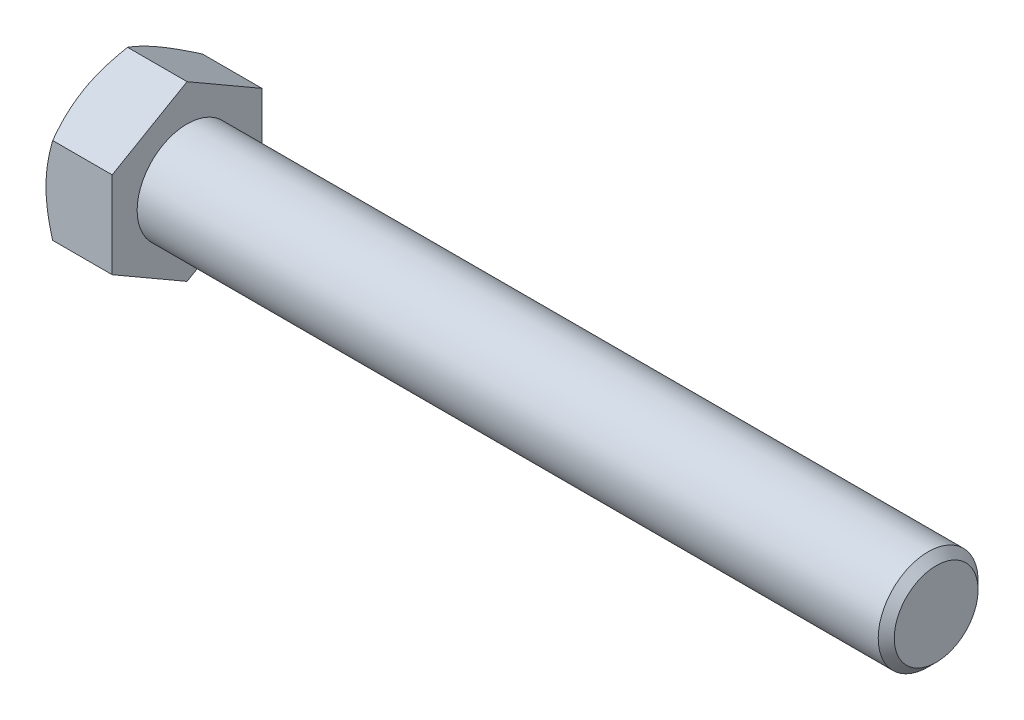
ISO-10303-21;
HEADER;
FILE_DESCRIPTION(('STEP AP214'),'2;1');
FILE_NAME('part.step','',(''),(''),'','','');
FILE_SCHEMA(('AUTOMOTIVE_DESIGN { 1 0 10303 214 1 1 1 1 }'));
ENDSEC;
DATA;
#1=APPLICATION_CONTEXT('core data for automotive mechanical design processes');
#2=APPLICATION_PROTOCOL_DEFINITION('international standard','automotive_design',2000,#1);
#3=PRODUCT_CONTEXT('',#1,'mechanical');
#4=PRODUCT('Part','Part','',(#3));
#5=PRODUCT_RELATED_PRODUCT_CATEGORY('part','',(#4));
#6=PRODUCT_DEFINITION_FORMATION('','',#4);
#7=PRODUCT_DEFINITION_CONTEXT('part definition',#1,'design');
#8=PRODUCT_DEFINITION('design','',#6,#7);
#9=PRODUCT_DEFINITION_SHAPE('','',#8);
#10=(LENGTH_UNIT() NAMED_UNIT(*) SI_UNIT(.MILLI.,.METRE.));
#11=(NAMED_UNIT(*) PLANE_ANGLE_UNIT() SI_UNIT($,.RADIAN.));
#12=(NAMED_UNIT(*) SI_UNIT($,.STERADIAN.) SOLID_ANGLE_UNIT());
#13=UNCERTAINTY_MEASURE_WITH_UNIT(LENGTH_MEASURE(1.E-05),#10,'distance_accuracy_value','');
#14=(GEOMETRIC_REPRESENTATION_CONTEXT(3) GLOBAL_UNCERTAINTY_ASSIGNED_CONTEXT((#13)) GLOBAL_UNIT_ASSIGNED_CONTEXT((#10,
#11,#12)) REPRESENTATION_CONTEXT('',''));
#15=CARTESIAN_POINT('',(0.,0.,0.));
#16=DIRECTION('',(0.,0.,1.));
#17=DIRECTION('',(1.,0.,0.));
#18=AXIS2_PLACEMENT_3D('',#15,#16,#17);
#19=CARTESIAN_POINT('',(7.95,5.19615242270663,-9.));
#20=DIRECTION('',(0.,-0.866025403784438,0.500000000000001));
#21=DIRECTION('',(0.,-0.500000000000001,-0.866025403784438));
#22=AXIS2_PLACEMENT_3D('',#19,#20,#21);
#23=PLANE('',#22);
#24=CARTESIAN_POINT('',(0.803914245071132,10.3924203154671,0.0002));
#25=CARTESIAN_POINT('',(0.737982001874055,10.2782163639798,-0.197607046401217));
#26=CARTESIAN_POINT('',(0.675041409210312,10.1635669787649,-0.396185606649946));
#27=CARTESIAN_POINT('',(0.555968997655536,9.93333715083391,-0.79495536604421));
#28=CARTESIAN_POINT('',(0.499840117752062,9.81775632901308,-0.99514722181845));
#29=CARTESIAN_POINT('',(0.395151960728961,9.58544915100228,-1.3975150570961));
#30=CARTESIAN_POINT('',(0.346610772912785,9.46872074181186,-1.5996945925006));
#31=CARTESIAN_POINT('',(0.25814851678792,9.23447001335913,-2.00542875589074));
#32=CARTESIAN_POINT('',(0.218225687483273,9.11694786135374,-2.20898309417891));
#33=CARTESIAN_POINT('',(0.148684674147114,8.88408932604662,-2.61230590830691));
#34=CARTESIAN_POINT('',(0.118837502847799,8.76877014301847,-2.812044592399));
#35=CARTESIAN_POINT('',(0.0687933098590806,8.53761579013205,-3.21241567598899));
#36=CARTESIAN_POINT('',(0.0485954355375389,8.42178066677662,-3.4130479949416));
#37=CARTESIAN_POINT('',(0.0183543473973466,8.18990950036671,-3.81466063597382));
#38=CARTESIAN_POINT('',(0.00829960958430291,8.07387383570153,-4.01564030266394));
#39=CARTESIAN_POINT('',(-0.00143766485491856,7.84169571742973,-4.41778459991642));
#40=CARTESIAN_POINT('',(-0.00112052193524544,7.72555326723328,-4.61894922457222));
#41=CARTESIAN_POINT('',(0.00916395215317108,7.50842142195782,-4.9950326125305));
#42=CARTESIAN_POINT('',(0.0178767400303951,7.40741671639993,-5.16997789436029));
#43=CARTESIAN_POINT('',(0.0429773400653684,7.20564389241818,-5.51945867708335));
#44=CARTESIAN_POINT('',(0.0593656695806683,7.10487579040239,-5.69399414955697));
#45=CARTESIAN_POINT('',(0.119656556235829,6.8029615939808,-6.21692487728551));
#46=CARTESIAN_POINT('',(0.174677482341127,6.60234990505054,-6.56439451510491));
#47=CARTESIAN_POINT('',(0.312230476325148,6.1989985076226,-7.263019628754));
#48=CARTESIAN_POINT('',(0.395345618627104,5.99631027619252,-7.61408594368717));
#49=CARTESIAN_POINT('',(0.583982539436458,5.59395639760763,-8.31098330401861));
#50=CARTESIAN_POINT('',(0.689460012893354,5.39428559809852,-8.65682327355628));
#51=CARTESIAN_POINT('',(0.803914245071127,5.19603695265279,-9.0002));
#52=B_SPLINE_CURVE_WITH_KNOTS('',3,(#24,#25,#26,#27,#28,#29,#30,#31,#32,#33,#34,#35,#36,#37,#38,
#39,#40,#41,#42,#43,#44,#45,#46,#47,#48,#49,#50,#51),.UNSPECIFIED.,.F.,.F.,(4,2,2,2,2,2,2,2,2,2,
2,2,2,4),(0.,0.713219249102578,1.42674513853509,2.14194697262263,2.85700253034481,
3.55449749123034,4.25193080859215,4.94857085059645,5.64518936892663,6.25162976378284,
6.85811104066341,8.07193747617894,9.31268391793542,10.5509947443908),.UNSPECIFIED.);
#53=CARTESIAN_POINT('',(0.803847577293366,10.3923048454133,0.));
#54=VERTEX_POINT('',#53);
#55=CARTESIAN_POINT('',(0.,7.79422863405994,-4.50000000000001));
#56=VERTEX_POINT('',#55);
#57=EDGE_CURVE('E51',#54,#56,#52,.T.);
#58=ORIENTED_EDGE('',*,*,#57,.F.);
#59=DIRECTION('',(-1.,0.,0.));
#60=VECTOR('',#59,1.);
#61=CARTESIAN_POINT('',(7.95,10.3923048454133,0.));
#62=LINE('',#61,#60);
#63=CARTESIAN_POINT('',(7.95,10.3923048454133,0.));
#64=VERTEX_POINT('',#63);
#65=EDGE_CURVE('E147',#64,#54,#62,.T.);
#66=ORIENTED_EDGE('',*,*,#65,.F.);
#67=DIRECTION('',(0.,0.500000000000001,0.866025403784438));
#68=VECTOR('',#67,1.);
#69=CARTESIAN_POINT('',(7.95,5.19615242270663,-9.));
#70=LINE('',#69,#68);
#71=CARTESIAN_POINT('',(7.95,5.19615242270663,-9.));
#72=VERTEX_POINT('',#71);
#73=EDGE_CURVE('E232',#72,#64,#70,.T.);
#74=ORIENTED_EDGE('',*,*,#73,.F.);
#75=DIRECTION('',(-1.,0.,0.));
#76=VECTOR('',#75,1.);
#77=CARTESIAN_POINT('',(7.95,5.19615242270663,-9.));
#78=LINE('',#77,#76);
#79=CARTESIAN_POINT('',(0.803847577293361,5.19615242270663,-9.));
#80=VERTEX_POINT('',#79);
#81=EDGE_CURVE('E135',#72,#80,#78,.T.);
#82=ORIENTED_EDGE('',*,*,#81,.T.);
#83=EDGE_CURVE('E129',#56,#80,#52,.T.);
#84=ORIENTED_EDGE('',*,*,#83,.F.);
#85=EDGE_LOOP('',(#58,#66,#74,#82,#84));
#86=FACE_BOUND('',#85,.T.);
#87=ADVANCED_FACE('F35',(#86),#23,.F.);
#88=CARTESIAN_POINT('',(7.95,10.3923048454133,0.));
#89=DIRECTION('',(0.,-0.866025403784438,-0.500000000000001));
#90=DIRECTION('',(0.,0.500000000000001,-0.866025403784438));
#91=AXIS2_PLACEMENT_3D('',#88,#89,#90);
#92=PLANE('',#91);
#93=CARTESIAN_POINT('',(0.803914245071126,5.19603695265279,9.0002));
#94=CARTESIAN_POINT('',(0.737982001874049,5.31024090414013,8.80239295359879));
#95=CARTESIAN_POINT('',(0.675041409210307,5.42489028935502,8.60381439335006));
#96=CARTESIAN_POINT('',(0.555968997655531,5.65512011728599,8.20504463395579));
#97=CARTESIAN_POINT('',(0.499840117752057,5.77070093910681,8.00485277818155));
#98=CARTESIAN_POINT('',(0.395151960728957,6.00300811711761,7.6024849429039));
#99=CARTESIAN_POINT('',(0.346610772912781,6.11973652630803,7.4003054074994));
#100=CARTESIAN_POINT('',(0.258148516787916,6.35398725476076,6.99457124410926));
#101=CARTESIAN_POINT('',(0.21822568748327,6.47150940676615,6.79101690582109));
#102=CARTESIAN_POINT('',(0.148684674147111,6.70436794207327,6.38769409169309));
#103=CARTESIAN_POINT('',(0.118837502847797,6.81968712510142,6.187955407601));
#104=CARTESIAN_POINT('',(0.0687933098590788,7.05084147798785,5.78758432401101));
#105=CARTESIAN_POINT('',(0.0485954355375368,7.16667660134328,5.5869520050584));
#106=CARTESIAN_POINT('',(0.0183543473973442,7.39854776775318,5.18533936402619));
#107=CARTESIAN_POINT('',(0.00829960958430043,7.51458343241836,4.98435969733607));
#108=CARTESIAN_POINT('',(-0.00143766485492008,7.74676155069016,4.58221540008358));
#109=CARTESIAN_POINT('',(-0.00112052193524597,7.86290400088661,4.38105077542778));
#110=CARTESIAN_POINT('',(0.00916395215317157,8.08003584616207,4.0049673874695));
#111=CARTESIAN_POINT('',(0.0178767400303957,8.18104055171996,3.83002210563971));
#112=CARTESIAN_POINT('',(0.042977340065369,8.38281337570172,3.48054132291666));
#113=CARTESIAN_POINT('',(0.0593656695806686,8.4835814777175,3.30600585044303));
#114=CARTESIAN_POINT('',(0.119656556235829,8.7854956741391,2.7830751227145));
#115=CARTESIAN_POINT('',(0.174677482341129,8.98610736306936,2.43560548489509));
#116=CARTESIAN_POINT('',(0.312230476325152,9.38945876049729,1.736980371246));
#117=CARTESIAN_POINT('',(0.395345618627108,9.59214699192737,1.38591405631283));
#118=CARTESIAN_POINT('',(0.583982539436463,9.99450087051226,0.689016695981395));
#119=CARTESIAN_POINT('',(0.689460012893358,10.1941716700214,0.343176726443721));
#120=CARTESIAN_POINT('',(0.803914245071132,10.3924203154671,-0.000199999999999286));
#121=B_SPLINE_CURVE_WITH_KNOTS('',3,(#93,#94,#95,#96,#97,#98,#99,#100,#101,#102,#103,#104,#105,
#106,#107,#108,#109,#110,#111,#112,#113,#114,#115,#116,#117,#118,#119,#120),.UNSPECIFIED.,.F.,
.F.,(4,2,2,2,2,2,2,2,2,2,2,2,2,4),(0.,0.713219249102575,1.42674513853509,2.14194697262263,
2.8570025303448,3.55449749123034,4.25193080859215,4.94857085059645,5.64518936892662,
6.25162976378284,6.85811104066341,8.07193747617894,9.31268391793542,10.5509947443908),.UNSPECIFIED.);
#122=CARTESIAN_POINT('',(0.803847577293361,5.19615242270662,9.));
#123=VERTEX_POINT('',#122);
#124=CARTESIAN_POINT('',(0.,7.79422863405994,4.50000000000001));
#125=VERTEX_POINT('',#124);
#126=EDGE_CURVE('E58',#123,#125,#121,.T.);
#127=ORIENTED_EDGE('',*,*,#126,.F.);
#128=DIRECTION('',(-1.,0.,0.));
#129=VECTOR('',#128,1.);
#130=CARTESIAN_POINT('',(7.95,5.19615242270662,9.));
#131=LINE('',#130,#129);
#132=CARTESIAN_POINT('',(7.95,5.19615242270662,9.));
#133=VERTEX_POINT('',#132);
#134=EDGE_CURVE('E145',#133,#123,#131,.T.);
#135=ORIENTED_EDGE('',*,*,#134,.F.);
#136=DIRECTION('',(0.,-0.500000000000001,0.866025403784438));
#137=VECTOR('',#136,1.);
#138=CARTESIAN_POINT('',(7.95,10.3923048454133,0.));
#139=LINE('',#138,#137);
#140=EDGE_CURVE('E230',#64,#133,#139,.T.);
#141=ORIENTED_EDGE('',*,*,#140,.F.);
#142=ORIENTED_EDGE('',*,*,#65,.T.);
#143=EDGE_CURVE('E162',#125,#54,#121,.T.);
#144=ORIENTED_EDGE('',*,*,#143,.F.);
#145=EDGE_LOOP('',(#127,#135,#141,#142,#144));
#146=FACE_BOUND('',#145,.T.);
#147=ADVANCED_FACE('F168',(#146),#92,.F.);
#148=CARTESIAN_POINT('',(7.95,5.19615242270662,9.));
#149=DIRECTION('',(0.,0.,-1.));
#150=DIRECTION('',(0.,1.,0.));
#151=AXIS2_PLACEMENT_3D('',#148,#149,#150);
#152=PLANE('',#151);
#153=CARTESIAN_POINT('',(4.50308345116277,-14.1853984650015,9.));
#154=CARTESIAN_POINT('',(4.31054430443784,-13.7903499522352,9.));
#155=CARTESIAN_POINT('',(4.11978647586973,-13.3944187196266,9.));
#156=CARTESIAN_POINT('',(3.74283090620237,-12.6003222266755,9.));
#157=CARTESIAN_POINT('',(3.55663384146594,-12.2021566456113,9.));
#158=CARTESIAN_POINT('',(3.18890856344589,-11.4011783965729,9.));
#159=CARTESIAN_POINT('',(3.0074093906765,-10.9983523517116,9.));
#160=CARTESIAN_POINT('',(2.65153988681449,-10.1895752665153,9.));
#161=CARTESIAN_POINT('',(2.47716923358453,-9.78362436837965,9.));
#162=CARTESIAN_POINT('',(2.13161244926932,-8.95398189189403,9.));
#163=CARTESIAN_POINT('',(1.96074001408349,-8.53015895315935,9.));
#164=CARTESIAN_POINT('',(1.6313841002326,-7.67764040403064,9.));
#165=CARTESIAN_POINT('',(1.47290197976962,-7.24894426532906,9.));
#166=CARTESIAN_POINT('',(1.1723215513794,-6.38672363138018,9.));
#167=CARTESIAN_POINT('',(1.03019194474471,-5.95321016213062,9.));
#168=CARTESIAN_POINT('',(0.76672466838971,-5.07998336095628,9.));
#169=CARTESIAN_POINT('',(0.645380685452071,-4.64027195560257,9.));
#170=CARTESIAN_POINT('',(0.429822600041213,-3.756825057697,9.));
#171=CARTESIAN_POINT('',(0.335452586446515,-3.31312863828559,9.));
#172=CARTESIAN_POINT('',(0.218090109997796,-2.64336713305662,9.));
#173=CARTESIAN_POINT('',(0.182999862158404,-2.41939560703655,9.));
#174=CARTESIAN_POINT('',(0.121565667357831,-1.97026354386693,9.));
#175=CARTESIAN_POINT('',(0.0952208701204457,-1.7451031244712,9.));
#176=CARTESIAN_POINT('',(0.0521451472278622,-1.29693480879163,9.));
#177=CARTESIAN_POINT('',(0.035288979864269,-1.07393900194963,9.));
#178=CARTESIAN_POINT('',(0.0110310639342793,-0.627433600763168,9.));
#179=CARTESIAN_POINT('',(0.00362915208926436,-0.403924015358647,9.));
#180=CARTESIAN_POINT('',(-0.00154262379217562,0.0432079361744724,9.));
#181=CARTESIAN_POINT('',(0.000687480645622932,0.266830301931543,9.));
#182=CARTESIAN_POINT('',(0.0147226077234489,0.713776872824045,9.));
#183=CARTESIAN_POINT('',(0.0265280659472994,0.937101063932554,9.));
#184=CARTESIAN_POINT('',(0.0656502898571845,1.46707211896633,9.));
#185=CARTESIAN_POINT('',(0.0971347677291179,1.77341845056799,9.));
#186=CARTESIAN_POINT('',(0.176454333238001,2.38397028008964,9.));
#187=CARTESIAN_POINT('',(0.224291457717819,2.68817550649947,9.));
#188=CARTESIAN_POINT('',(0.389806402965321,3.59715813116673,9.));
#189=CARTESIAN_POINT('',(0.529461896846409,4.19799412652229,9.));
#190=CARTESIAN_POINT('',(0.773331871848963,5.09670706348808,9.));
#191=CARTESIAN_POINT('',(0.861532431142624,5.39919910543192,9.));
#192=CARTESIAN_POINT('',(1.04752099203162,6.00125026101992,9.));
#193=CARTESIAN_POINT('',(1.14530906206942,6.30080935370982,9.));
#194=CARTESIAN_POINT('',(1.34886866039495,6.89708058771338,9.));
#195=CARTESIAN_POINT('',(1.4546378769001,7.19379352557784,9.));
#196=CARTESIAN_POINT('',(1.67287301968739,7.78473287386441,9.));
#197=CARTESIAN_POINT('',(1.78533883473292,8.07895932549667,9.));
#198=CARTESIAN_POINT('',(2.07523735271453,8.81619444901846,9.));
#199=CARTESIAN_POINT('',(2.25629467011384,9.25777584408893,9.));
#200=CARTESIAN_POINT('',(2.62827522263085,10.1367776511577,9.));
#201=CARTESIAN_POINT('',(2.81919928705197,10.5741977097237,9.));
#202=CARTESIAN_POINT('',(3.20877963371491,11.4457286497122,9.));
#203=CARTESIAN_POINT('',(3.40743823107646,11.8798384930871,9.));
#204=CARTESIAN_POINT('',(3.81079737205717,12.7452179469075,9.));
#205=CARTESIAN_POINT('',(4.01549773502307,13.1764876418049,9.));
#206=CARTESIAN_POINT('',(4.43000777500987,14.0372827141757,9.));
#207=CARTESIAN_POINT('',(4.63982402220294,14.466804921625,9.));
#208=CARTESIAN_POINT('',(5.0633687133929,15.3239162694583,9.));
#209=CARTESIAN_POINT('',(5.27709718099327,15.7515053981602,9.));
#210=CARTESIAN_POINT('',(5.70771289609101,16.6049951424422,9.));
#211=CARTESIAN_POINT('',(5.92459958876704,17.0308960382694,9.));
#212=CARTESIAN_POINT('',(6.36101693257489,17.8813418239716,9.));
#213=CARTESIAN_POINT('',(6.58054759472945,18.305886708184,9.));
#214=CARTESIAN_POINT('',(7.20096689356042,19.4981240117253,9.));
#215=CARTESIAN_POINT('',(7.60436223424865,20.2645118375987,9.));
#216=CARTESIAN_POINT('',(8.41646747703505,21.7945065925678,9.));
#217=CARTESIAN_POINT('',(8.82517763220601,22.558113387008,9.));
#218=CARTESIAN_POINT('',(9.6453899211846,24.08088542414,9.));
#219=CARTESIAN_POINT('',(10.0568800806834,24.8400571209878,9.));
#220=CARTESIAN_POINT('',(10.6764233675492,25.9775231898088,9.));
#221=CARTESIAN_POINT('',(10.8833155902988,26.3564507889065,9.));
#222=CARTESIAN_POINT('',(11.2977907102886,27.1139273756374,9.));
#223=CARTESIAN_POINT('',(11.5053736065156,27.492476363825,9.));
#224=CARTESIAN_POINT('',(11.7132605802834,27.8708583347745,9.));
#225=B_SPLINE_CURVE_WITH_KNOTS('',3,(#153,#154,#155,#156,#157,#158,#159,#160,#161,#162,#163,
#164,#165,#166,#167,#168,#169,#170,#171,#172,#173,#174,#175,#176,#177,#178,#179,#180,#181,#182,
#183,#184,#185,#186,#187,#188,#189,#190,#191,#192,#193,#194,#195,#196,#197,#198,#199,#200,#201,
#202,#203,#204,#205,#206,#207,#208,#209,#210,#211,#212,#213,#214,#215,#216,#217,#218,#219,#220,
#221,#222,#223,#224),.UNSPECIFIED.,.F.,.F.,(4,2,2,2,2,2,2,2,2,2,2,2,2,2,2,2,2,2,2,2,2,2,2,2,2,2,
2,2,2,2,2,2,2,2,2,4),(0.,1.31842765114838,2.6370496560634,3.96247407620816,5.28783853415268,
6.65860358746619,8.02951869129603,9.39776460603693,10.7655942037288,12.1253499441535,
12.8053173169584,13.4852185605779,14.1559216013657,14.8266130586982,15.4973023208461,
16.1680220944284,17.0913849082023,18.0148627755644,19.862742604473,20.8079230410616,
21.75311022551,22.6980246745777,23.6429234321322,25.0745302305723,26.5062575523684,
27.9384167676661,29.3705332036396,30.8045973553514,32.2386701620091,33.6724940065179,
35.1063238307244,37.7045032490067,40.3028068397952,42.8933552129343,44.1885437295509,
45.4837303472314),.UNSPECIFIED.);
#226=CARTESIAN_POINT('',(0.803847577293365,-5.19615242270664,9.));
#227=VERTEX_POINT('',#226);
#228=CARTESIAN_POINT('',(0.,0.,9.));
#229=VERTEX_POINT('',#228);
#230=EDGE_CURVE('E242',#227,#229,#225,.T.);
#231=ORIENTED_EDGE('',*,*,#230,.F.);
#232=DIRECTION('',(-1.,0.,0.));
#233=VECTOR('',#232,1.);
#234=CARTESIAN_POINT('',(7.95,-5.19615242270664,9.));
#235=LINE('',#234,#233);
#236=CARTESIAN_POINT('',(7.95,-5.19615242270664,9.));
#237=VERTEX_POINT('',#236);
#238=EDGE_CURVE('E137',#237,#227,#235,.T.);
#239=ORIENTED_EDGE('',*,*,#238,.F.);
#240=DIRECTION('',(0.,-1.,0.));
#241=VECTOR('',#240,1.);
#242=CARTESIAN_POINT('',(7.95,5.19615242270662,9.));
#243=LINE('',#242,#241);
#244=EDGE_CURVE('E226',#133,#237,#243,.T.);
#245=ORIENTED_EDGE('',*,*,#244,.F.);
#246=ORIENTED_EDGE('',*,*,#134,.T.);
#247=EDGE_CURVE('E184',#229,#123,#225,.T.);
#248=ORIENTED_EDGE('',*,*,#247,.F.);
#249=EDGE_LOOP('',(#231,#239,#245,#246,#248));
#250=FACE_BOUND('',#249,.T.);
#251=ADVANCED_FACE('F248',(#250),#152,.F.);
#252=CARTESIAN_POINT('',(7.95,-10.3923048454133,0.));
#253=DIRECTION('',(0.,0.866025403784438,-0.500000000000001));
#254=DIRECTION('',(0.,0.500000000000001,0.866025403784438));
#255=AXIS2_PLACEMENT_3D('',#252,#253,#254);
#256=PLANE('',#255);
#257=CARTESIAN_POINT('',(0.803914245071142,-10.3924203154671,-0.000199999999999654));
#258=CARTESIAN_POINT('',(0.737982001874063,-10.2782163639798,0.197607046401217));
#259=CARTESIAN_POINT('',(0.675041409210322,-10.1635669787649,0.396185606649946));
#260=CARTESIAN_POINT('',(0.555968997655546,-9.93333715083392,0.794955366044211));
#261=CARTESIAN_POINT('',(0.499840117752072,-9.81775632901309,0.995147221818451));
#262=CARTESIAN_POINT('',(0.395151960728971,-9.5854491510023,1.3975150570961));
#263=CARTESIAN_POINT('',(0.346610772912794,-9.46872074181188,1.5996945925006));
#264=CARTESIAN_POINT('',(0.258148516787928,-9.23447001335914,2.00542875589075));
#265=CARTESIAN_POINT('',(0.218225687483282,-9.11694786135376,2.20898309417891));
#266=CARTESIAN_POINT('',(0.148684674147123,-8.88408932604663,2.61230590830692));
#267=CARTESIAN_POINT('',(0.118837502847808,-8.76877014301848,2.81204459239901));
#268=CARTESIAN_POINT('',(0.0687933098590893,-8.53761579013206,3.212415675989));
#269=CARTESIAN_POINT('',(0.0485954355375467,-8.42178066677663,3.41304799494161));
#270=CARTESIAN_POINT('',(0.0183543473973538,-8.18990950036672,3.81466063597382));
#271=CARTESIAN_POINT('',(0.00829960958431041,-8.07387383570154,4.01564030266394));
#272=CARTESIAN_POINT('',(-0.00143766485491053,-7.84169571742975,4.41778459991643));
#273=CARTESIAN_POINT('',(-0.00112052193523718,-7.72555326723329,4.61894922457223));
#274=CARTESIAN_POINT('',(0.00916395215317887,-7.50842142195783,4.99503261253051));
#275=CARTESIAN_POINT('',(0.0178767400304022,-7.40741671639995,5.1699778943603));
#276=CARTESIAN_POINT('',(0.042977340065375,-7.20564389241819,5.51945867708335));
#277=CARTESIAN_POINT('',(0.0593656695806751,-7.1048757904024,5.69399414955697));
#278=CARTESIAN_POINT('',(0.119656556235836,-6.80296159398081,6.21692487728551));
#279=CARTESIAN_POINT('',(0.174677482341134,-6.60234990505055,6.56439451510492));
#280=CARTESIAN_POINT('',(0.312230476325155,-6.19899850762261,7.263019628754));
#281=CARTESIAN_POINT('',(0.39534561862711,-5.99631027619254,7.61408594368717));
#282=CARTESIAN_POINT('',(0.583982539436463,-5.59395639760764,8.31098330401861));
#283=CARTESIAN_POINT('',(0.689460012893357,-5.39428559809854,8.65682327355628));
#284=CARTESIAN_POINT('',(0.80391424507113,-5.1960369526528,9.0002));
#285=B_SPLINE_CURVE_WITH_KNOTS('',3,(#257,#258,#259,#260,#261,#262,#263,#264,#265,#266,#267,
#268,#269,#270,#271,#272,#273,#274,#275,#276,#277,#278,#279,#280,#281,#282,#283,#284),
.UNSPECIFIED.,.F.,.F.,(4,2,2,2,2,2,2,2,2,2,2,2,2,4),(0.,0.713219249102578,1.42674513853509,
2.14194697262263,2.85700253034481,3.55449749123035,4.25193080859216,4.94857085059646,
5.64518936892664,6.25162976378285,6.85811104066341,8.07193747617895,9.31268391793542,
10.5509947443908),.UNSPECIFIED.);
#286=CARTESIAN_POINT('',(0.803847577293377,-10.3923048454133,0.));
#287=VERTEX_POINT('',#286);
#288=CARTESIAN_POINT('',(0.,-7.79422863405994,4.50000000000001));
#289=VERTEX_POINT('',#288);
#290=EDGE_CURVE('E170',#287,#289,#285,.T.);
#291=ORIENTED_EDGE('',*,*,#290,.F.);
#292=DIRECTION('',(-1.,0.,0.));
#293=VECTOR('',#292,1.);
#294=CARTESIAN_POINT('',(7.95,-10.3923048454133,0.));
#295=LINE('',#294,#293);
#296=CARTESIAN_POINT('',(7.95,-10.3923048454133,0.));
#297=VERTEX_POINT('',#296);
#298=EDGE_CURVE('E134',#297,#287,#295,.T.);
#299=ORIENTED_EDGE('',*,*,#298,.F.);
#300=DIRECTION('',(0.,-0.500000000000001,-0.866025403784438));
#301=VECTOR('',#300,1.);
#302=CARTESIAN_POINT('',(7.95,-10.3923048454133,0.));
#303=LINE('',#302,#301);
#304=EDGE_CURVE('E224',#237,#297,#303,.T.);
#305=ORIENTED_EDGE('',*,*,#304,.F.);
#306=ORIENTED_EDGE('',*,*,#238,.T.);
#307=EDGE_CURVE('E172',#289,#227,#285,.T.);
#308=ORIENTED_EDGE('',*,*,#307,.F.);
#309=EDGE_LOOP('',(#291,#299,#305,#306,#308));
#310=FACE_BOUND('',#309,.T.);
#311=ADVANCED_FACE('F220',(#310),#256,.F.);
#312=CARTESIAN_POINT('',(7.95,-5.19615242270664,-9.));
#313=DIRECTION('',(0.,0.866025403784438,0.500000000000001));
#314=DIRECTION('',(0.,-0.500000000000001,0.866025403784438));
#315=AXIS2_PLACEMENT_3D('',#312,#313,#314);
#316=PLANE('',#315);
#317=CARTESIAN_POINT('',(0.803914245071135,-5.19603695265281,-9.0002));
#318=CARTESIAN_POINT('',(0.737982001874056,-5.31024090414015,-8.80239295359879));
#319=CARTESIAN_POINT('',(0.675041409210314,-5.42489028935505,-8.60381439335006));
#320=CARTESIAN_POINT('',(0.555968997655539,-5.65512011728601,-8.20504463395579));
#321=CARTESIAN_POINT('',(0.499840117752066,-5.77070093910684,-8.00485277818155));
#322=CARTESIAN_POINT('',(0.395151960728966,-6.00300811711763,-7.6024849429039));
#323=CARTESIAN_POINT('',(0.346610772912789,-6.11973652630806,-7.40030540749941));
#324=CARTESIAN_POINT('',(0.258148516787924,-6.35398725476079,-6.99457124410926));
#325=CARTESIAN_POINT('',(0.218225687483278,-6.47150940676617,-6.79101690582109));
#326=CARTESIAN_POINT('',(0.14868467414712,-6.70436794207329,-6.38769409169309));
#327=CARTESIAN_POINT('',(0.118837502847806,-6.81968712510144,-6.187955407601));
#328=CARTESIAN_POINT('',(0.0687933098590882,-7.05084147798787,-5.78758432401101));
#329=CARTESIAN_POINT('',(0.0485954355375464,-7.1666766013433,-5.58695200505839));
#330=CARTESIAN_POINT('',(0.0183543473973546,-7.3985477677532,-5.18533936402618));
#331=CARTESIAN_POINT('',(0.00829960958431132,-7.51458343241838,-4.98435969733607));
#332=CARTESIAN_POINT('',(-0.00143766485490945,-7.74676155069018,-4.58221540008358));
#333=CARTESIAN_POINT('',(-0.00112052193523606,-7.86290400088664,-4.38105077542778));
#334=CARTESIAN_POINT('',(0.00916395215318163,-8.0800358461621,-4.0049673874695));
#335=CARTESIAN_POINT('',(0.0178767400304064,-8.18104055171998,-3.83002210563971));
#336=CARTESIAN_POINT('',(0.04297734006538,-8.38281337570174,-3.48054132291665));
#337=CARTESIAN_POINT('',(0.0593656695806794,-8.48358147771752,-3.30600585044303));
#338=CARTESIAN_POINT('',(0.11965655623584,-8.78549567413912,-2.7830751227145));
#339=CARTESIAN_POINT('',(0.174677482341139,-8.98610736306938,-2.43560548489509));
#340=CARTESIAN_POINT('',(0.312230476325162,-9.38945876049731,-1.736980371246));
#341=CARTESIAN_POINT('',(0.395345618627118,-9.59214699192739,-1.38591405631283));
#342=CARTESIAN_POINT('',(0.583982539436472,-9.99450087051228,-0.689016695981394));
#343=CARTESIAN_POINT('',(0.689460012893367,-10.1941716700214,-0.343176726443721));
#344=CARTESIAN_POINT('',(0.803914245071142,-10.3924203154671,0.000199999999999566));
#345=B_SPLINE_CURVE_WITH_KNOTS('',3,(#317,#318,#319,#320,#321,#322,#323,#324,#325,#326,#327,
#328,#329,#330,#331,#332,#333,#334,#335,#336,#337,#338,#339,#340,#341,#342,#343,#344),
.UNSPECIFIED.,.F.,.F.,(4,2,2,2,2,2,2,2,2,2,2,2,2,4),(0.,0.713219249102579,1.42674513853509,
2.14194697262263,2.85700253034481,3.55449749123034,4.25193080859215,4.94857085059645,
5.64518936892663,6.25162976378284,6.85811104066341,8.07193747617895,9.31268391793542,
10.5509947443908),.UNSPECIFIED.);
#346=CARTESIAN_POINT('',(0.803847577293114,-5.19615242270703,-9.));
#347=VERTEX_POINT('',#346);
#348=CARTESIAN_POINT('',(0.,-7.79422863405994,-4.5));
#349=VERTEX_POINT('',#348);
#350=EDGE_CURVE('E111',#347,#349,#345,.T.);
#351=ORIENTED_EDGE('',*,*,#350,.F.);
#352=DIRECTION('',(-1.,0.,0.));
#353=VECTOR('',#352,1.);
#354=CARTESIAN_POINT('',(7.95,-5.19615242270664,-9.));
#355=LINE('',#354,#353);
#356=CARTESIAN_POINT('',(7.95,-5.19615242270664,-9.));
#357=VERTEX_POINT('',#356);
#358=EDGE_CURVE('E125',#357,#347,#355,.T.);
#359=ORIENTED_EDGE('',*,*,#358,.F.);
#360=DIRECTION('',(0.,0.500000000000001,-0.866025403784438));
#361=VECTOR('',#360,1.);
#362=CARTESIAN_POINT('',(7.95,-5.19615242270664,-9.));
#363=LINE('',#362,#361);
#364=EDGE_CURVE('E222',#297,#357,#363,.T.);
#365=ORIENTED_EDGE('',*,*,#364,.F.);
#366=ORIENTED_EDGE('',*,*,#298,.T.);
#367=EDGE_CURVE('E128',#349,#287,#345,.T.);
#368=ORIENTED_EDGE('',*,*,#367,.F.);
#369=EDGE_LOOP('',(#351,#359,#365,#366,#368));
#370=FACE_BOUND('',#369,.T.);
#371=ADVANCED_FACE('F123',(#370),#316,.F.);
#372=CARTESIAN_POINT('',(7.95,5.19615242270663,-9.));
#373=DIRECTION('',(0.,0.,1.));
#374=DIRECTION('',(0.,-1.,0.));
#375=AXIS2_PLACEMENT_3D('',#372,#373,#374);
#376=PLANE('',#375);
#377=CARTESIAN_POINT('',(4.50308345606078,-14.1853984750485,-9.00000000000001));
#378=CARTESIAN_POINT('',(4.31054430913195,-13.7903499619441,-9.00000000000001));
#379=CARTESIAN_POINT('',(4.11978648036007,-13.3944187289973,-9.00000000000001));
#380=CARTESIAN_POINT('',(3.74283091028612,-12.6003222353684,-9.00000000000001));
#381=CARTESIAN_POINT('',(3.55663384534689,-12.2021566539649,-9.00000000000001));
#382=CARTESIAN_POINT('',(3.18890856692114,-11.4011784042428,-9.00000000000001));
#383=CARTESIAN_POINT('',(3.00740939394888,-10.998352359037,-9.00000000000001));
#384=CARTESIAN_POINT('',(2.65153988968446,-10.1895752731496,-9.00000000000001));
#385=CARTESIAN_POINT('',(2.47716923625496,-9.78362437466718,-9.00000000000001));
#386=CARTESIAN_POINT('',(2.13161245153419,-8.95398189745991,-9.00000000000001));
#387=CARTESIAN_POINT('',(1.96074001614284,-8.53015895835009,-9.00000000000001));
#388=CARTESIAN_POINT('',(1.63138410189175,-7.6776404084651,-9.00000000000001));
#389=CARTESIAN_POINT('',(1.4729019812341,-7.24894426938241,-9.));
#390=CARTESIAN_POINT('',(1.17232155247294,-6.38672363466423,-9.));
#391=CARTESIAN_POINT('',(1.03019194566191,-5.95321016502653,-9.));
#392=CARTESIAN_POINT('',(0.766724668982652,-5.07998336306547,-9.));
#393=CARTESIAN_POINT('',(0.645380685897064,-4.64027195731318,-9.));
#394=CARTESIAN_POINT('',(0.4298226001874,-3.75682505840835,-9.));
#395=CARTESIAN_POINT('',(0.335452586452977,-3.31312863839349,-9.00000000000001));
#396=CARTESIAN_POINT('',(0.218090109862417,-2.64336713224849,-9.));
#397=CARTESIAN_POINT('',(0.182999861987048,-2.41939560592137,-9.));
#398=CARTESIAN_POINT('',(0.121565667139733,-1.97026354213498,-9.));
#399=CARTESIAN_POINT('',(0.0952208698915764,-1.74510312242953,-9.));
#400=CARTESIAN_POINT('',(0.0521451470049091,-1.29693480613702,-9.));
#401=CARTESIAN_POINT('',(0.0352889796574924,-1.07393899899183,-9.));
#402=CARTESIAN_POINT('',(0.0110310637867485,-0.627433597199466,-9.));
#403=CARTESIAN_POINT('',(0.00362915198480241,-0.403924011492238,-9.));
#404=CARTESIAN_POINT('',(-0.00154262378413736,0.0432079406441064,-9.));
#405=CARTESIAN_POINT('',(0.000687480723096652,0.266830306701696,-9.));
#406=CARTESIAN_POINT('',(0.0147226079643596,0.713776878191376,-9.));
#407=CARTESIAN_POINT('',(0.0265280662822141,0.937101069596544,-9.));
#408=CARTESIAN_POINT('',(0.0656502904232112,1.46707212508443,-9.));
#409=CARTESIAN_POINT('',(0.0971347684278846,1.77341845684227,-9.));
#410=CARTESIAN_POINT('',(0.176454334209292,2.38397028666908,-9.));
#411=CARTESIAN_POINT('',(0.224291458828894,2.6881755132279,-9.));
#412=CARTESIAN_POINT('',(0.389806404498591,3.59715813833381,-9.));
#413=CARTESIAN_POINT('',(0.529461898664751,4.19799413397004,-9.));
#414=CARTESIAN_POINT('',(0.7733318740876,5.09670707135543,-9.));
#415=CARTESIAN_POINT('',(0.861532433522242,5.39919911344212,-9.));
#416=CARTESIAN_POINT('',(1.04752099468878,6.00125026931415,-9.));
#417=CARTESIAN_POINT('',(1.14530906486313,6.30080936214523,-9.));
#418=CARTESIAN_POINT('',(1.34886866345677,6.89708059643009,-9.));
#419=CARTESIAN_POINT('',(1.45463788009346,7.19379353443466,-9.));
#420=CARTESIAN_POINT('',(1.67287302313913,7.78473288300146,-9.));
#421=CARTESIAN_POINT('',(1.78533883831151,8.07895933477384,-9.));
#422=CARTESIAN_POINT('',(2.07523735650253,8.81619445838354,-9.));
#423=CARTESIAN_POINT('',(2.25629467397395,9.25777585340505,-9.));
#424=CARTESIAN_POINT('',(2.6282752266166,10.1367776603819,-9.));
#425=CARTESIAN_POINT('',(2.81919929109124,10.5741977189049,-9.));
#426=CARTESIAN_POINT('',(3.20877963784731,11.4457286588119,-9.));
#427=CARTESIAN_POINT('',(3.40743823524846,11.8798385021483,-9.));
#428=CARTESIAN_POINT('',(3.81079737629817,12.7452179558959,-9.));
#429=CARTESIAN_POINT('',(4.01549773929348,13.1764876507589,-9.));
#430=CARTESIAN_POINT('',(4.43000777933055,14.0372827230624,-9.));
#431=CARTESIAN_POINT('',(4.63982402654445,14.4668049304786,-9.));
#432=CARTESIAN_POINT('',(5.06336871777017,15.3239162782486,-9.));
#433=CARTESIAN_POINT('',(5.27709718538548,15.7515054069201,-9.));
#434=CARTESIAN_POINT('',(5.70771290050867,16.6049951511436,-9.));
#435=CARTESIAN_POINT('',(5.92459959319522,17.0308960469429,-9.));
#436=CARTESIAN_POINT('',(6.36101693702058,17.8813418325907,-9.));
#437=CARTESIAN_POINT('',(6.58054759918212,18.3058867167768,-8.99999999999999));
#438=CARTESIAN_POINT('',(7.20096689804886,19.4981240202845,-8.99999999999999));
#439=CARTESIAN_POINT('',(7.60436223876306,20.264511846152,-8.99999999999999));
#440=CARTESIAN_POINT('',(8.41646748159571,21.794506601112,-8.99999999999999));
#441=CARTESIAN_POINT('',(8.82517763678694,22.5581133955489,-8.99999999999999));
#442=CARTESIAN_POINT('',(9.64538992580601,24.0808854326838,-8.99999999999999));
#443=CARTESIAN_POINT('',(10.0568800853251,24.8400571295377,-8.99999999999999));
#444=CARTESIAN_POINT('',(10.6764233722193,25.977523198369,-8.99999999999999));
#445=CARTESIAN_POINT('',(10.883315594978,26.3564507974704,-8.99999999999999));
#446=CARTESIAN_POINT('',(11.2977907149855,27.1139273842089,-8.99999999999999));
#447=CARTESIAN_POINT('',(11.5053736112211,27.4924763724004,-8.99999999999999));
#448=CARTESIAN_POINT('',(11.7132605849971,27.870858343354,-8.99999999999999));
#449=B_SPLINE_CURVE_WITH_KNOTS('',3,(#377,#378,#379,#380,#381,#382,#383,#384,#385,#386,#387,
#388,#389,#390,#391,#392,#393,#394,#395,#396,#397,#398,#399,#400,#401,#402,#403,#404,#405,#406,
#407,#408,#409,#410,#411,#412,#413,#414,#415,#416,#417,#418,#419,#420,#421,#422,#423,#424,#425,
#426,#427,#428,#429,#430,#431,#432,#433,#434,#435,#436,#437,#438,#439,#440,#441,#442,#443,#444,
#445,#446,#447,#448),.UNSPECIFIED.,.F.,.F.,(4,2,2,2,2,2,2,2,2,2,2,2,2,2,2,2,2,2,2,2,2,2,2,2,2,2,
2,2,2,2,2,2,2,2,2,4),(0.,1.3184276523281,2.63704965842302,3.96247407975987,5.28783853889642,
6.65860359348418,8.02951869858869,9.39776461460018,10.7655942135616,12.1253499558398,
12.8053173295709,13.4852185741162,14.1559216158065,14.8266130740414,15.4973023370921,
16.1680221115773,17.0913849258577,18.0148627937263,19.8627426236502,20.8079230607688,
21.7531102457472,22.6980246953435,23.6429234534266,25.0745302518135,26.5062575735559,
27.9384167887983,29.3705332247166,30.804597376367,32.2386701829632,33.6724940274115,
35.1063238515574,37.7045032698604,40.3028068606692,42.8933552338532,44.1885437504927,
45.4837303681959),.UNSPECIFIED.);
#450=CARTESIAN_POINT('',(0.,0.,-9.));
#451=VERTEX_POINT('',#450);
#452=EDGE_CURVE('E117',#80,#451,#449,.F.);
#453=ORIENTED_EDGE('',*,*,#452,.F.);
#454=ORIENTED_EDGE('',*,*,#81,.F.);
#455=DIRECTION('',(0.,1.,0.));
#456=VECTOR('',#455,1.);
#457=CARTESIAN_POINT('',(7.95,5.19615242270663,-9.));
#458=LINE('',#457,#456);
#459=EDGE_CURVE('E133',#357,#72,#458,.T.);
#460=ORIENTED_EDGE('',*,*,#459,.F.);
#461=ORIENTED_EDGE('',*,*,#358,.T.);
#462=EDGE_CURVE('E108',#451,#347,#449,.F.);
#463=ORIENTED_EDGE('',*,*,#462,.F.);
#464=EDGE_LOOP('',(#453,#454,#460,#461,#463));
#465=FACE_BOUND('',#464,.T.);
#466=ADVANCED_FACE('F131',(#465),#376,.F.);
#467=CARTESIAN_POINT('',(7.95,10.3923048454133,0.));
#468=DIRECTION('',(1.,0.,0.));
#469=DIRECTION('',(0.,0.,-1.));
#470=AXIS2_PLACEMENT_3D('',#467,#468,#469);
#471=PLANE('',#470);
#472=CARTESIAN_POINT('',(7.95,0.,0.));
#473=DIRECTION('',(1.,0.,0.));
#474=DIRECTION('',(0.,0.,-1.));
#475=AXIS2_PLACEMENT_3D('',#472,#473,#474);
#476=CIRCLE('',#475,6.);
#477=CARTESIAN_POINT('',(7.95,0.,-6.));
#478=VERTEX_POINT('',#477);
#479=EDGE_CURVE('E235',#478,#478,#476,.F.);
#480=ORIENTED_EDGE('',*,*,#479,.T.);
#481=EDGE_LOOP('',(#480));
#482=FACE_BOUND('',#481,.T.);
#483=ORIENTED_EDGE('',*,*,#73,.T.);
#484=ORIENTED_EDGE('',*,*,#140,.T.);
#485=ORIENTED_EDGE('',*,*,#244,.T.);
#486=ORIENTED_EDGE('',*,*,#304,.T.);
#487=ORIENTED_EDGE('',*,*,#364,.T.);
#488=ORIENTED_EDGE('',*,*,#459,.T.);
#489=EDGE_LOOP('',(#483,#484,#485,#486,#487,#488));
#490=FACE_BOUND('',#489,.T.);
#491=ADVANCED_FACE('F250',(#482,#490),#471,.T.);
#492=CARTESIAN_POINT('',(0.,0.,0.));
#493=DIRECTION('',(-1.,0.,0.));
#494=DIRECTION('',(0.,0.,1.));
#495=AXIS2_PLACEMENT_3D('',#492,#493,#494);
#496=CYLINDRICAL_SURFACE('',#495,6.);
#497=ORIENTED_EDGE('',*,*,#479,.F.);
#498=EDGE_LOOP('',(#497));
#499=FACE_BOUND('',#498,.T.);
#500=CARTESIAN_POINT('',(96.986,0.,0.));
#501=DIRECTION('',(-1.,0.,0.));
#502=DIRECTION('',(0.,0.,1.));
#503=AXIS2_PLACEMENT_3D('',#500,#501,#502);
#504=CIRCLE('',#503,6.);
#505=CARTESIAN_POINT('',(96.986,0.,6.));
#506=VERTEX_POINT('',#505);
#507=EDGE_CURVE('E238',#506,#506,#504,.T.);
#508=ORIENTED_EDGE('',*,*,#507,.T.);
#509=EDGE_LOOP('',(#508));
#510=FACE_BOUND('',#509,.T.);
#511=ADVANCED_FACE('F281',(#499,#510),#496,.T.);
#512=CARTESIAN_POINT('',(97.95,0.,0.));
#513=DIRECTION('',(-1.,0.,0.));
#514=DIRECTION('',(0.,0.,1.));
#515=AXIS2_PLACEMENT_3D('',#512,#513,#514);
#516=CONICAL_SURFACE('',#515,5.036,0.785398163397452);
#517=ORIENTED_EDGE('',*,*,#507,.F.);
#518=EDGE_LOOP('',(#517));
#519=FACE_BOUND('',#518,.T.);
#520=CARTESIAN_POINT('',(97.95,0.,0.));
#521=DIRECTION('',(-1.,0.,0.));
#522=DIRECTION('',(0.,0.,1.));
#523=AXIS2_PLACEMENT_3D('',#520,#521,#522);
#524=CIRCLE('',#523,5.036);
#525=CARTESIAN_POINT('',(97.95,0.,5.036));
#526=VERTEX_POINT('',#525);
#527=EDGE_CURVE('E240',#526,#526,#524,.T.);
#528=ORIENTED_EDGE('',*,*,#527,.T.);
#529=EDGE_LOOP('',(#528));
#530=FACE_BOUND('',#529,.T.);
#531=ADVANCED_FACE('F284',(#519,#530),#516,.T.);
#532=CARTESIAN_POINT('',(97.95,0.,0.));
#533=DIRECTION('',(-1.,0.,0.));
#534=DIRECTION('',(0.,0.,1.));
#535=AXIS2_PLACEMENT_3D('',#532,#533,#534);
#536=PLANE('',#535);
#537=ORIENTED_EDGE('',*,*,#527,.F.);
#538=EDGE_LOOP('',(#537));
#539=FACE_BOUND('',#538,.T.);
#540=ADVANCED_FACE('F197',(#539),#536,.F.);
#541=CARTESIAN_POINT('',(0.,0.,0.));
#542=DIRECTION('',(1.,0.,0.));
#543=DIRECTION('',(0.,0.,-1.));
#544=AXIS2_PLACEMENT_3D('',#541,#542,#543);
#545=CONICAL_SURFACE('',#544,9.,1.0471975511966);
#546=ORIENTED_EDGE('',*,*,#350,.T.);
#547=CARTESIAN_POINT('',(0.,0.,0.));
#548=DIRECTION('',(1.,0.,0.));
#549=DIRECTION('',(0.,0.,-1.));
#550=AXIS2_PLACEMENT_3D('',#547,#548,#549);
#551=CIRCLE('',#550,9.);
#552=EDGE_CURVE('E39',#349,#451,#551,.T.);
#553=ORIENTED_EDGE('',*,*,#552,.T.);
#554=ORIENTED_EDGE('',*,*,#462,.T.);
#555=EDGE_LOOP('',(#546,#553,#554));
#556=FACE_BOUND('',#555,.T.);
#557=ADVANCED_FACE('F110',(#556),#545,.T.);
#558=ORIENTED_EDGE('',*,*,#290,.T.);
#559=EDGE_CURVE('E152',#289,#349,#551,.T.);
#560=ORIENTED_EDGE('',*,*,#559,.T.);
#561=ORIENTED_EDGE('',*,*,#367,.T.);
#562=EDGE_LOOP('',(#558,#560,#561));
#563=FACE_BOUND('',#562,.T.);
#564=ADVANCED_FACE('F196',(#563),#545,.T.);
#565=ORIENTED_EDGE('',*,*,#230,.T.);
#566=EDGE_CURVE('E153',#229,#289,#551,.T.);
#567=ORIENTED_EDGE('',*,*,#566,.T.);
#568=ORIENTED_EDGE('',*,*,#307,.T.);
#569=EDGE_LOOP('',(#565,#567,#568));
#570=FACE_BOUND('',#569,.T.);
#571=ADVANCED_FACE('F191',(#570),#545,.T.);
#572=ORIENTED_EDGE('',*,*,#247,.T.);
#573=ORIENTED_EDGE('',*,*,#126,.T.);
#574=CARTESIAN_POINT('',(0.,0.,0.));
#575=DIRECTION('',(-1.,0.,0.));
#576=DIRECTION('',(0.,0.,1.));
#577=AXIS2_PLACEMENT_3D('',#574,#575,#576);
#578=CIRCLE('',#577,9.);
#579=EDGE_CURVE('E118',#229,#125,#578,.T.);
#580=ORIENTED_EDGE('',*,*,#579,.F.);
#581=EDGE_LOOP('',(#572,#573,#580));
#582=FACE_BOUND('',#581,.T.);
#583=ADVANCED_FACE('F195',(#582),#545,.T.);
#584=ORIENTED_EDGE('',*,*,#143,.T.);
#585=ORIENTED_EDGE('',*,*,#57,.T.);
#586=EDGE_CURVE('E44',#56,#125,#551,.T.);
#587=ORIENTED_EDGE('',*,*,#586,.T.);
#588=EDGE_LOOP('',(#584,#585,#587));
#589=FACE_BOUND('',#588,.T.);
#590=ADVANCED_FACE('F161',(#589),#545,.T.);
#591=ORIENTED_EDGE('',*,*,#83,.T.);
#592=ORIENTED_EDGE('',*,*,#452,.T.);
#593=EDGE_CURVE('E11',#451,#56,#551,.T.);
#594=ORIENTED_EDGE('',*,*,#593,.T.);
#595=EDGE_LOOP('',(#591,#592,#594));
#596=FACE_BOUND('',#595,.T.);
#597=ADVANCED_FACE('F253',(#596),#545,.T.);
#598=CARTESIAN_POINT('',(0.,10.3923048454133,0.));
#599=DIRECTION('',(1.,0.,0.));
#600=DIRECTION('',(0.,0.,-1.));
#601=AXIS2_PLACEMENT_3D('',#598,#599,#600);
#602=PLANE('',#601);
#603=ORIENTED_EDGE('',*,*,#593,.F.);
#604=ORIENTED_EDGE('',*,*,#552,.F.);
#605=ORIENTED_EDGE('',*,*,#559,.F.);
#606=ORIENTED_EDGE('',*,*,#566,.F.);
#607=ORIENTED_EDGE('',*,*,#579,.T.);
#608=ORIENTED_EDGE('',*,*,#586,.F.);
#609=EDGE_LOOP('',(#603,#604,#605,#606,#607,#608));
#610=FACE_BOUND('',#609,.T.);
#611=ADVANCED_FACE('F165',(#610),#602,.F.);
#612=CLOSED_SHELL('',(#87,#147,#251,#311,#371,#466,#491,#511,#531,#540,#557,#564,#571,#583,#590,
#597,#611));
#613=MANIFOLD_SOLID_BREP('B2',#612);
#614=ADVANCED_BREP_SHAPE_REPRESENTATION('',(#18,#613),#14);
#615=SHAPE_DEFINITION_REPRESENTATION(#9,#614);
ENDSEC;
END-ISO-10303-21;
